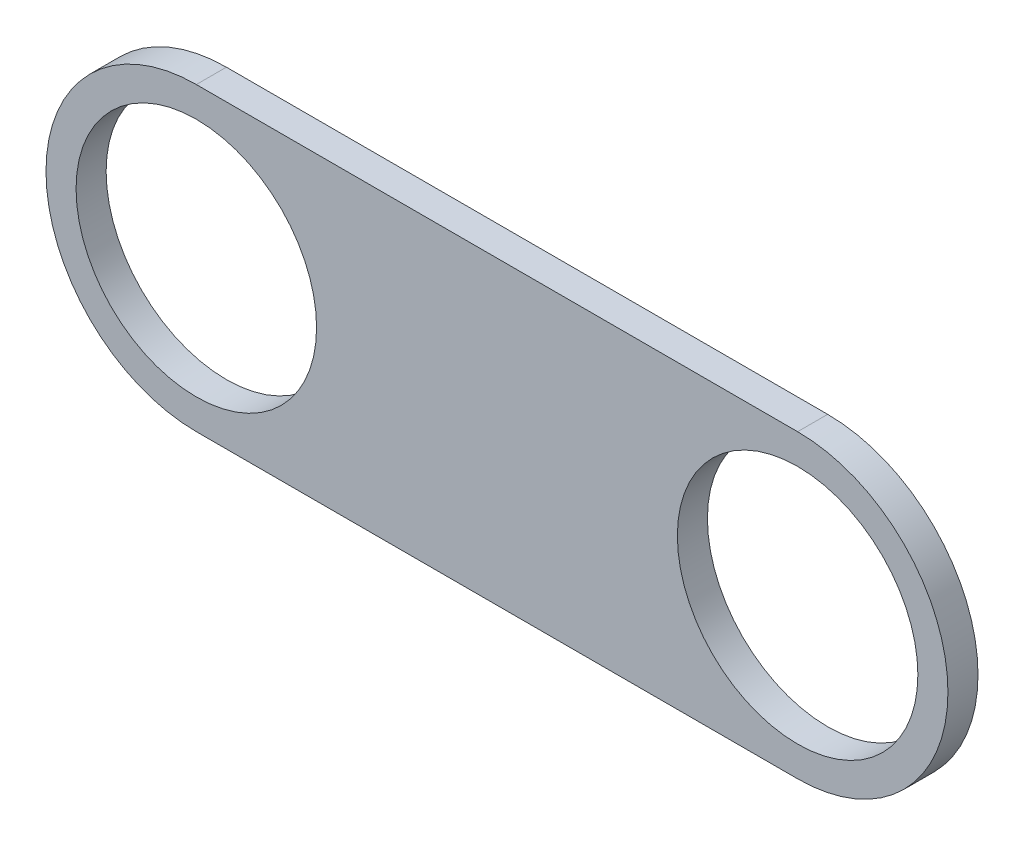
ISO-10303-21;
HEADER;
FILE_DESCRIPTION(('STEP AP214'),'2;1');
FILE_NAME('part.step','',(''),(''),'','','');
FILE_SCHEMA(('AUTOMOTIVE_DESIGN { 1 0 10303 214 1 1 1 1 }'));
ENDSEC;
DATA;
#1=APPLICATION_CONTEXT('core data for automotive mechanical design processes');
#2=APPLICATION_PROTOCOL_DEFINITION('international standard','automotive_design',2000,#1);
#3=PRODUCT_CONTEXT('',#1,'mechanical');
#4=PRODUCT('Part','Part','',(#3));
#5=PRODUCT_RELATED_PRODUCT_CATEGORY('part','',(#4));
#6=PRODUCT_DEFINITION_FORMATION('','',#4);
#7=PRODUCT_DEFINITION_CONTEXT('part definition',#1,'design');
#8=PRODUCT_DEFINITION('design','',#6,#7);
#9=PRODUCT_DEFINITION_SHAPE('','',#8);
#10=(LENGTH_UNIT() NAMED_UNIT(*) SI_UNIT(.MILLI.,.METRE.));
#11=(NAMED_UNIT(*) PLANE_ANGLE_UNIT() SI_UNIT($,.RADIAN.));
#12=(NAMED_UNIT(*) SI_UNIT($,.STERADIAN.) SOLID_ANGLE_UNIT());
#13=UNCERTAINTY_MEASURE_WITH_UNIT(LENGTH_MEASURE(1.E-05),#10,'distance_accuracy_value','');
#14=(GEOMETRIC_REPRESENTATION_CONTEXT(3) GLOBAL_UNCERTAINTY_ASSIGNED_CONTEXT((#13)) GLOBAL_UNIT_ASSIGNED_CONTEXT((#10,
#11,#12)) REPRESENTATION_CONTEXT('',''));
#15=CARTESIAN_POINT('',(0.,0.,0.));
#16=DIRECTION('',(0.,0.,1.));
#17=DIRECTION('',(1.,0.,0.));
#18=AXIS2_PLACEMENT_3D('',#15,#16,#17);
#19=CARTESIAN_POINT('',(-83.6111999384292,-57.9419454072012,1.27));
#20=DIRECTION('',(0.,0.,1.));
#21=DIRECTION('',(1.,0.,0.));
#22=AXIS2_PLACEMENT_3D('',#19,#20,#21);
#23=PLANE('',#22);
#24=CARTESIAN_POINT('',(-58.2111999384292,-57.9419454072012,1.27));
#25=DIRECTION('',(0.,0.,1.));
#26=DIRECTION('',(1.,0.,0.));
#27=AXIS2_PLACEMENT_3D('',#24,#25,#26);
#28=CIRCLE('',#27,5.08000000000001);
#29=CARTESIAN_POINT('',(-53.1311999384292,-57.9419454072012,1.27));
#30=VERTEX_POINT('',#29);
#31=EDGE_CURVE('E100',#30,#30,#28,.T.);
#32=ORIENTED_EDGE('',*,*,#31,.F.);
#33=EDGE_LOOP('',(#32));
#34=FACE_BOUND('',#33,.T.);
#35=CARTESIAN_POINT('',(-83.6111999384292,-57.9419454072012,1.27));
#36=DIRECTION('',(0.,0.,1.));
#37=DIRECTION('',(1.,0.,0.));
#38=AXIS2_PLACEMENT_3D('',#35,#36,#37);
#39=CIRCLE('',#38,6.35);
#40=CARTESIAN_POINT('',(-83.6111999384292,-51.5919454072012,1.27));
#41=VERTEX_POINT('',#40);
#42=CARTESIAN_POINT('',(-83.6111999384292,-64.2919454072012,1.27));
#43=VERTEX_POINT('',#42);
#44=EDGE_CURVE('E85',#41,#43,#39,.T.);
#45=ORIENTED_EDGE('',*,*,#44,.T.);
#46=DIRECTION('',(1.,0.,0.));
#47=VECTOR('',#46,1.);
#48=CARTESIAN_POINT('',(-83.6111999384292,-64.2919454072012,1.27));
#49=LINE('',#48,#47);
#50=CARTESIAN_POINT('',(-58.2111999384292,-64.2919454072012,1.27));
#51=VERTEX_POINT('',#50);
#52=EDGE_CURVE('E80',#43,#51,#49,.T.);
#53=ORIENTED_EDGE('',*,*,#52,.T.);
#54=CARTESIAN_POINT('',(-58.2111999384292,-57.9419454072012,1.27));
#55=DIRECTION('',(0.,0.,1.));
#56=DIRECTION('',(1.,0.,0.));
#57=AXIS2_PLACEMENT_3D('',#54,#55,#56);
#58=CIRCLE('',#57,6.35);
#59=CARTESIAN_POINT('',(-58.2111999384292,-51.5919454072012,1.27));
#60=VERTEX_POINT('',#59);
#61=EDGE_CURVE('E83',#51,#60,#58,.T.);
#62=ORIENTED_EDGE('',*,*,#61,.T.);
#63=DIRECTION('',(-1.,0.,0.));
#64=VECTOR('',#63,1.);
#65=CARTESIAN_POINT('',(-83.6111999384292,-51.5919454072012,1.27));
#66=LINE('',#65,#64);
#67=EDGE_CURVE('E50',#60,#41,#66,.T.);
#68=ORIENTED_EDGE('',*,*,#67,.T.);
#69=EDGE_LOOP('',(#45,#53,#62,#68));
#70=FACE_BOUND('',#69,.T.);
#71=CARTESIAN_POINT('',(-83.6111999384292,-57.9419454072012,1.27));
#72=DIRECTION('',(0.,0.,1.));
#73=DIRECTION('',(1.,0.,0.));
#74=AXIS2_PLACEMENT_3D('',#71,#72,#73);
#75=CIRCLE('',#74,5.08000000000001);
#76=CARTESIAN_POINT('',(-78.5311999384292,-57.9419454072012,1.27));
#77=VERTEX_POINT('',#76);
#78=EDGE_CURVE('E115',#77,#77,#75,.T.);
#79=ORIENTED_EDGE('',*,*,#78,.F.);
#80=EDGE_LOOP('',(#79));
#81=FACE_BOUND('',#80,.T.);
#82=ADVANCED_FACE('F33',(#34,#70,#81),#23,.T.);
#83=CARTESIAN_POINT('',(-83.6111999384292,-57.9419454072012,0.));
#84=DIRECTION('',(0.,0.,1.));
#85=DIRECTION('',(1.,0.,0.));
#86=AXIS2_PLACEMENT_3D('',#83,#84,#85);
#87=PLANE('',#86);
#88=CARTESIAN_POINT('',(-58.2111999384292,-57.9419454072012,0.));
#89=DIRECTION('',(0.,0.,1.));
#90=DIRECTION('',(1.,0.,0.));
#91=AXIS2_PLACEMENT_3D('',#88,#89,#90);
#92=CIRCLE('',#91,5.08000000000001);
#93=CARTESIAN_POINT('',(-53.1311999384292,-57.9419454072012,0.));
#94=VERTEX_POINT('',#93);
#95=EDGE_CURVE('E112',#94,#94,#92,.T.);
#96=ORIENTED_EDGE('',*,*,#95,.T.);
#97=EDGE_LOOP('',(#96));
#98=FACE_BOUND('',#97,.T.);
#99=CARTESIAN_POINT('',(-83.6111999384292,-57.9419454072012,0.));
#100=DIRECTION('',(0.,0.,1.));
#101=DIRECTION('',(1.,0.,0.));
#102=AXIS2_PLACEMENT_3D('',#99,#100,#101);
#103=CIRCLE('',#102,6.35);
#104=CARTESIAN_POINT('',(-83.6111999384292,-51.5919454072012,0.));
#105=VERTEX_POINT('',#104);
#106=CARTESIAN_POINT('',(-83.6111999384292,-64.2919454072012,0.));
#107=VERTEX_POINT('',#106);
#108=EDGE_CURVE('E97',#105,#107,#103,.T.);
#109=ORIENTED_EDGE('',*,*,#108,.F.);
#110=DIRECTION('',(-1.,0.,0.));
#111=VECTOR('',#110,1.);
#112=CARTESIAN_POINT('',(-83.6111999384292,-51.5919454072012,0.));
#113=LINE('',#112,#111);
#114=CARTESIAN_POINT('',(-58.2111999384292,-51.5919454072012,0.));
#115=VERTEX_POINT('',#114);
#116=EDGE_CURVE('E73',#115,#105,#113,.T.);
#117=ORIENTED_EDGE('',*,*,#116,.F.);
#118=CARTESIAN_POINT('',(-58.2111999384292,-57.9419454072012,0.));
#119=DIRECTION('',(0.,0.,1.));
#120=DIRECTION('',(1.,0.,0.));
#121=AXIS2_PLACEMENT_3D('',#118,#119,#120);
#122=CIRCLE('',#121,6.35);
#123=CARTESIAN_POINT('',(-58.2111999384292,-64.2919454072012,0.));
#124=VERTEX_POINT('',#123);
#125=EDGE_CURVE('E67',#124,#115,#122,.T.);
#126=ORIENTED_EDGE('',*,*,#125,.F.);
#127=DIRECTION('',(1.,0.,0.));
#128=VECTOR('',#127,1.);
#129=CARTESIAN_POINT('',(-83.6111999384292,-64.2919454072012,0.));
#130=LINE('',#129,#128);
#131=EDGE_CURVE('E89',#107,#124,#130,.T.);
#132=ORIENTED_EDGE('',*,*,#131,.F.);
#133=EDGE_LOOP('',(#109,#117,#126,#132));
#134=FACE_BOUND('',#133,.T.);
#135=CARTESIAN_POINT('',(-83.6111999384292,-57.9419454072012,0.));
#136=DIRECTION('',(0.,0.,1.));
#137=DIRECTION('',(1.,0.,0.));
#138=AXIS2_PLACEMENT_3D('',#135,#136,#137);
#139=CIRCLE('',#138,5.08000000000001);
#140=CARTESIAN_POINT('',(-78.5311999384292,-57.9419454072012,0.));
#141=VERTEX_POINT('',#140);
#142=EDGE_CURVE('E118',#141,#141,#139,.T.);
#143=ORIENTED_EDGE('',*,*,#142,.T.);
#144=EDGE_LOOP('',(#143));
#145=FACE_BOUND('',#144,.T.);
#146=ADVANCED_FACE('F108',(#98,#134,#145),#87,.F.);
#147=CARTESIAN_POINT('',(-83.6111999384292,-57.9419454072012,1.27));
#148=DIRECTION('',(0.,0.,-1.));
#149=DIRECTION('',(-1.,0.,0.));
#150=AXIS2_PLACEMENT_3D('',#147,#148,#149);
#151=CYLINDRICAL_SURFACE('',#150,6.35);
#152=ORIENTED_EDGE('',*,*,#108,.T.);
#153=DIRECTION('',(0.,0.,-1.));
#154=VECTOR('',#153,1.);
#155=CARTESIAN_POINT('',(-83.6111999384292,-64.2919454072012,1.27));
#156=LINE('',#155,#154);
#157=EDGE_CURVE('E11',#43,#107,#156,.T.);
#158=ORIENTED_EDGE('',*,*,#157,.F.);
#159=ORIENTED_EDGE('',*,*,#44,.F.);
#160=DIRECTION('',(0.,0.,-1.));
#161=VECTOR('',#160,1.);
#162=CARTESIAN_POINT('',(-83.6111999384292,-51.5919454072012,1.27));
#163=LINE('',#162,#161);
#164=EDGE_CURVE('E93',#41,#105,#163,.T.);
#165=ORIENTED_EDGE('',*,*,#164,.T.);
#166=EDGE_LOOP('',(#152,#158,#159,#165));
#167=FACE_BOUND('',#166,.T.);
#168=ADVANCED_FACE('F35',(#167),#151,.T.);
#169=CARTESIAN_POINT('',(-83.6111999384292,-64.2919454072012,1.27));
#170=DIRECTION('',(0.,1.,0.));
#171=DIRECTION('',(0.,0.,1.));
#172=AXIS2_PLACEMENT_3D('',#169,#170,#171);
#173=PLANE('',#172);
#174=ORIENTED_EDGE('',*,*,#131,.T.);
#175=DIRECTION('',(0.,0.,-1.));
#176=VECTOR('',#175,1.);
#177=CARTESIAN_POINT('',(-58.2111999384292,-64.2919454072012,1.27));
#178=LINE('',#177,#176);
#179=EDGE_CURVE('E42',#51,#124,#178,.T.);
#180=ORIENTED_EDGE('',*,*,#179,.F.);
#181=ORIENTED_EDGE('',*,*,#52,.F.);
#182=ORIENTED_EDGE('',*,*,#157,.T.);
#183=EDGE_LOOP('',(#174,#180,#181,#182));
#184=FACE_BOUND('',#183,.T.);
#185=ADVANCED_FACE('F88',(#184),#173,.F.);
#186=CARTESIAN_POINT('',(-58.2111999384292,-57.9419454072012,1.27));
#187=DIRECTION('',(0.,0.,-1.));
#188=DIRECTION('',(-1.,0.,0.));
#189=AXIS2_PLACEMENT_3D('',#186,#187,#188);
#190=CYLINDRICAL_SURFACE('',#189,6.35);
#191=ORIENTED_EDGE('',*,*,#125,.T.);
#192=DIRECTION('',(0.,0.,-1.));
#193=VECTOR('',#192,1.);
#194=CARTESIAN_POINT('',(-58.2111999384292,-51.5919454072012,1.27));
#195=LINE('',#194,#193);
#196=EDGE_CURVE('E90',#60,#115,#195,.T.);
#197=ORIENTED_EDGE('',*,*,#196,.F.);
#198=ORIENTED_EDGE('',*,*,#61,.F.);
#199=ORIENTED_EDGE('',*,*,#179,.T.);
#200=EDGE_LOOP('',(#191,#197,#198,#199));
#201=FACE_BOUND('',#200,.T.);
#202=ADVANCED_FACE('F91',(#201),#190,.T.);
#203=CARTESIAN_POINT('',(-83.6111999384292,-51.5919454072012,1.27));
#204=DIRECTION('',(0.,-1.,0.));
#205=DIRECTION('',(0.,0.,-1.));
#206=AXIS2_PLACEMENT_3D('',#203,#204,#205);
#207=PLANE('',#206);
#208=ORIENTED_EDGE('',*,*,#116,.T.);
#209=ORIENTED_EDGE('',*,*,#164,.F.);
#210=ORIENTED_EDGE('',*,*,#67,.F.);
#211=ORIENTED_EDGE('',*,*,#196,.T.);
#212=EDGE_LOOP('',(#208,#209,#210,#211));
#213=FACE_BOUND('',#212,.T.);
#214=ADVANCED_FACE('F105',(#213),#207,.F.);
#215=CARTESIAN_POINT('',(-58.2111999384292,-57.9419454072012,1.27));
#216=DIRECTION('',(0.,0.,-1.));
#217=DIRECTION('',(-1.,0.,0.));
#218=AXIS2_PLACEMENT_3D('',#215,#216,#217);
#219=CYLINDRICAL_SURFACE('',#218,5.08000000000001);
#220=ORIENTED_EDGE('',*,*,#31,.T.);
#221=EDGE_LOOP('',(#220));
#222=FACE_BOUND('',#221,.T.);
#223=ORIENTED_EDGE('',*,*,#95,.F.);
#224=EDGE_LOOP('',(#223));
#225=FACE_BOUND('',#224,.T.);
#226=ADVANCED_FACE('F136',(#222,#225),#219,.F.);
#227=CARTESIAN_POINT('',(-83.6111999384292,-57.9419454072012,1.27));
#228=DIRECTION('',(0.,0.,-1.));
#229=DIRECTION('',(-1.,0.,0.));
#230=AXIS2_PLACEMENT_3D('',#227,#228,#229);
#231=CYLINDRICAL_SURFACE('',#230,5.08000000000001);
#232=ORIENTED_EDGE('',*,*,#78,.T.);
#233=EDGE_LOOP('',(#232));
#234=FACE_BOUND('',#233,.T.);
#235=ORIENTED_EDGE('',*,*,#142,.F.);
#236=EDGE_LOOP('',(#235));
#237=FACE_BOUND('',#236,.T.);
#238=ADVANCED_FACE('F124',(#234,#237),#231,.F.);
#239=CLOSED_SHELL('',(#82,#146,#168,#185,#202,#214,#226,#238));
#240=MANIFOLD_SOLID_BREP('B2',#239);
#241=ADVANCED_BREP_SHAPE_REPRESENTATION('',(#18,#240),#14);
#242=SHAPE_DEFINITION_REPRESENTATION(#9,#241);
ENDSEC;
END-ISO-10303-21;
